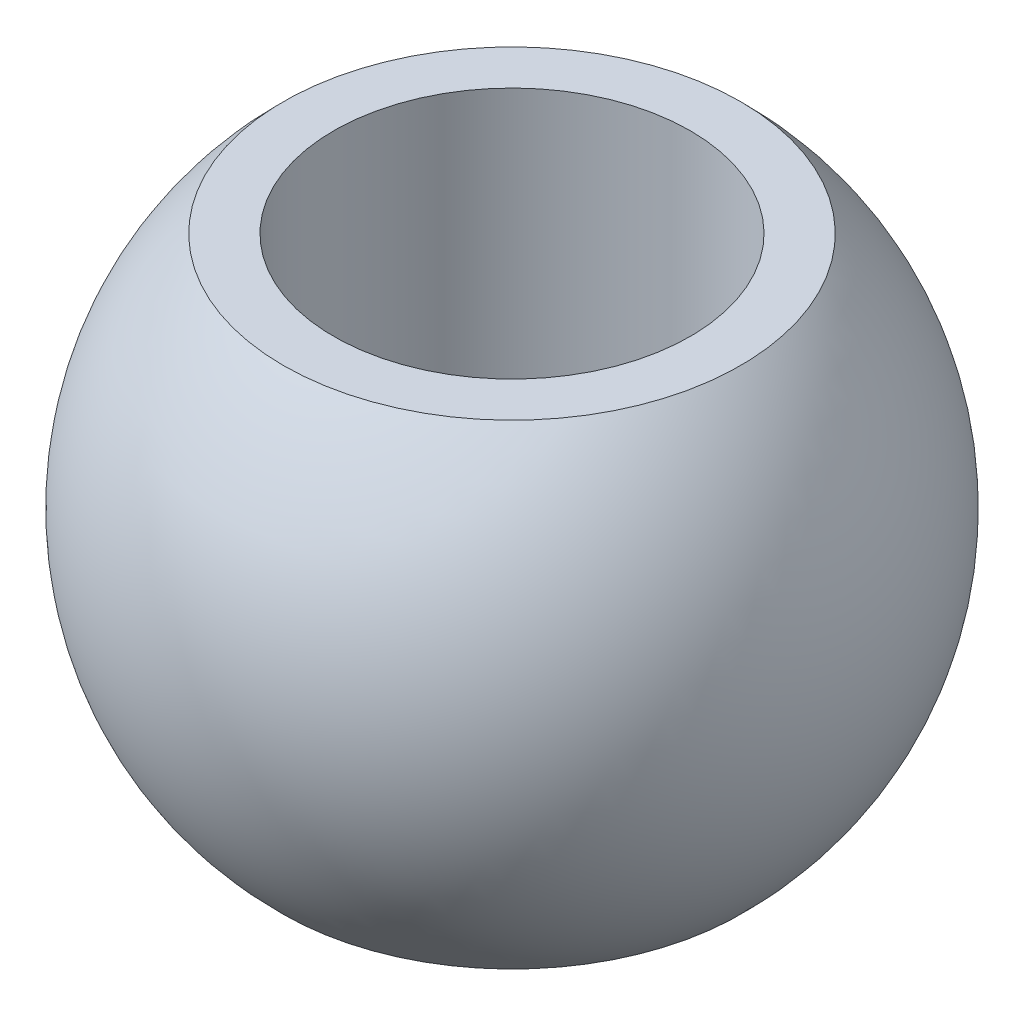
ISO-10303-21;
HEADER;
FILE_DESCRIPTION(('STEP AP214'),'2;1');
FILE_NAME('part.step','',(''),(''),'','','');
FILE_SCHEMA(('AUTOMOTIVE_DESIGN { 1 0 10303 214 1 1 1 1 }'));
ENDSEC;
DATA;
#1=APPLICATION_CONTEXT('core data for automotive mechanical design processes');
#2=APPLICATION_PROTOCOL_DEFINITION('international standard','automotive_design',2000,#1);
#3=PRODUCT_CONTEXT('',#1,'mechanical');
#4=PRODUCT('Part','Part','',(#3));
#5=PRODUCT_RELATED_PRODUCT_CATEGORY('part','',(#4));
#6=PRODUCT_DEFINITION_FORMATION('','',#4);
#7=PRODUCT_DEFINITION_CONTEXT('part definition',#1,'design');
#8=PRODUCT_DEFINITION('design','',#6,#7);
#9=PRODUCT_DEFINITION_SHAPE('','',#8);
#10=(LENGTH_UNIT() NAMED_UNIT(*) SI_UNIT(.MILLI.,.METRE.));
#11=(NAMED_UNIT(*) PLANE_ANGLE_UNIT() SI_UNIT($,.RADIAN.));
#12=(NAMED_UNIT(*) SI_UNIT($,.STERADIAN.) SOLID_ANGLE_UNIT());
#13=UNCERTAINTY_MEASURE_WITH_UNIT(LENGTH_MEASURE(1.E-05),#10,'distance_accuracy_value','');
#14=(GEOMETRIC_REPRESENTATION_CONTEXT(3) GLOBAL_UNCERTAINTY_ASSIGNED_CONTEXT((#13)) GLOBAL_UNIT_ASSIGNED_CONTEXT((#10,
#11,#12)) REPRESENTATION_CONTEXT('',''));
#15=CARTESIAN_POINT('',(0.,0.,0.));
#16=DIRECTION('',(0.,0.,1.));
#17=DIRECTION('',(1.,0.,0.));
#18=AXIS2_PLACEMENT_3D('',#15,#16,#17);
#19=CARTESIAN_POINT('',(6.,-8.,0.));
#20=DIRECTION('',(0.,-1.,0.));
#21=DIRECTION('',(0.,0.,-1.));
#22=AXIS2_PLACEMENT_3D('',#19,#20,#21);
#23=PLANE('',#22);
#24=CARTESIAN_POINT('',(0.,-8.,0.));
#25=DIRECTION('',(0.,-1.,0.));
#26=DIRECTION('',(0.,0.,-1.));
#27=AXIS2_PLACEMENT_3D('',#24,#25,#26);
#28=CIRCLE('',#27,7.69480344128425);
#29=CARTESIAN_POINT('',(0.,-8.,-7.69480344128425));
#30=VERTEX_POINT('',#29);
#31=EDGE_CURVE('E10',#30,#30,#28,.T.);
#32=ORIENTED_EDGE('',*,*,#31,.T.);
#33=EDGE_LOOP('',(#32));
#34=FACE_BOUND('',#33,.T.);
#35=CARTESIAN_POINT('',(0.,-8.,0.));
#36=DIRECTION('',(0.,-1.,0.));
#37=DIRECTION('',(0.,0.,-1.));
#38=AXIS2_PLACEMENT_3D('',#35,#36,#37);
#39=CIRCLE('',#38,6.);
#40=CARTESIAN_POINT('',(0.,-8.,-6.));
#41=VERTEX_POINT('',#40);
#42=EDGE_CURVE('E46',#41,#41,#39,.T.);
#43=ORIENTED_EDGE('',*,*,#42,.F.);
#44=EDGE_LOOP('',(#43));
#45=FACE_BOUND('',#44,.T.);
#46=ADVANCED_FACE('F32',(#34,#45),#23,.T.);
#47=CARTESIAN_POINT('',(0.,0.,0.));
#48=DIRECTION('',(0.,-1.,0.));
#49=DIRECTION('',(1.,0.,0.));
#50=AXIS2_PLACEMENT_3D('',#47,#48,#49);
#51=SPHERICAL_SURFACE('',#50,11.1);
#52=CARTESIAN_POINT('',(0.,8.,0.));
#53=DIRECTION('',(0.,-1.,0.));
#54=DIRECTION('',(0.,0.,-1.));
#55=AXIS2_PLACEMENT_3D('',#52,#53,#54);
#56=CIRCLE('',#55,7.69480344128425);
#57=CARTESIAN_POINT('',(0.,8.,-7.69480344128425));
#58=VERTEX_POINT('',#57);
#59=EDGE_CURVE('E38',#58,#58,#56,.T.);
#60=ORIENTED_EDGE('',*,*,#59,.T.);
#61=EDGE_LOOP('',(#60));
#62=FACE_BOUND('',#61,.T.);
#63=ORIENTED_EDGE('',*,*,#31,.F.);
#64=EDGE_LOOP('',(#63));
#65=FACE_BOUND('',#64,.T.);
#66=ADVANCED_FACE('F56',(#62,#65),#51,.T.);
#67=CARTESIAN_POINT('',(6.,8.,0.));
#68=DIRECTION('',(0.,1.,0.));
#69=DIRECTION('',(0.,0.,1.));
#70=AXIS2_PLACEMENT_3D('',#67,#68,#69);
#71=PLANE('',#70);
#72=CARTESIAN_POINT('',(0.,8.,0.));
#73=DIRECTION('',(0.,-1.,0.));
#74=DIRECTION('',(0.,0.,-1.));
#75=AXIS2_PLACEMENT_3D('',#72,#73,#74);
#76=CIRCLE('',#75,6.);
#77=CARTESIAN_POINT('',(0.,8.,-6.));
#78=VERTEX_POINT('',#77);
#79=EDGE_CURVE('E42',#78,#78,#76,.T.);
#80=ORIENTED_EDGE('',*,*,#79,.T.);
#81=EDGE_LOOP('',(#80));
#82=FACE_BOUND('',#81,.T.);
#83=ORIENTED_EDGE('',*,*,#59,.F.);
#84=EDGE_LOOP('',(#83));
#85=FACE_BOUND('',#84,.T.);
#86=ADVANCED_FACE('F60',(#82,#85),#71,.T.);
#87=CARTESIAN_POINT('',(0.,-11.1,0.));
#88=DIRECTION('',(0.,-1.,0.));
#89=DIRECTION('',(0.,0.,-1.));
#90=AXIS2_PLACEMENT_3D('',#87,#88,#89);
#91=CYLINDRICAL_SURFACE('',#90,6.);
#92=ORIENTED_EDGE('',*,*,#42,.T.);
#93=EDGE_LOOP('',(#92));
#94=FACE_BOUND('',#93,.T.);
#95=ORIENTED_EDGE('',*,*,#79,.F.);
#96=EDGE_LOOP('',(#95));
#97=FACE_BOUND('',#96,.T.);
#98=ADVANCED_FACE('F52',(#94,#97),#91,.F.);
#99=CLOSED_SHELL('',(#46,#66,#86,#98));
#100=MANIFOLD_SOLID_BREP('B2',#99);
#101=ADVANCED_BREP_SHAPE_REPRESENTATION('',(#18,#100),#14);
#102=SHAPE_DEFINITION_REPRESENTATION(#9,#101);
ENDSEC;
END-ISO-10303-21;
